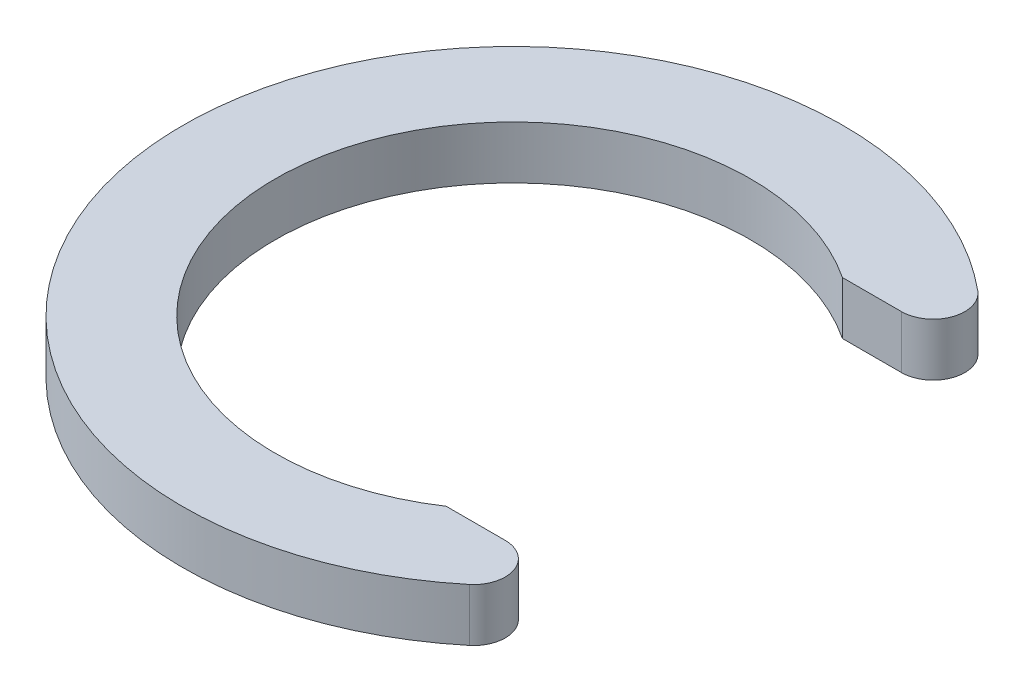
ISO-10303-21;
HEADER;
FILE_DESCRIPTION(('STEP AP214'),'2;1');
FILE_NAME('part.step','',(''),(''),'','','');
FILE_SCHEMA(('AUTOMOTIVE_DESIGN { 1 0 10303 214 1 1 1 1 }'));
ENDSEC;
DATA;
#1=APPLICATION_CONTEXT('core data for automotive mechanical design processes');
#2=APPLICATION_PROTOCOL_DEFINITION('international standard','automotive_design',2000,#1);
#3=PRODUCT_CONTEXT('',#1,'mechanical');
#4=PRODUCT('Part','Part','',(#3));
#5=PRODUCT_RELATED_PRODUCT_CATEGORY('part','',(#4));
#6=PRODUCT_DEFINITION_FORMATION('','',#4);
#7=PRODUCT_DEFINITION_CONTEXT('part definition',#1,'design');
#8=PRODUCT_DEFINITION('design','',#6,#7);
#9=PRODUCT_DEFINITION_SHAPE('','',#8);
#10=(LENGTH_UNIT() NAMED_UNIT(*) SI_UNIT(.MILLI.,.METRE.));
#11=(NAMED_UNIT(*) PLANE_ANGLE_UNIT() SI_UNIT($,.RADIAN.));
#12=(NAMED_UNIT(*) SI_UNIT($,.STERADIAN.) SOLID_ANGLE_UNIT());
#13=UNCERTAINTY_MEASURE_WITH_UNIT(LENGTH_MEASURE(1.E-05),#10,'distance_accuracy_value','');
#14=(GEOMETRIC_REPRESENTATION_CONTEXT(3) GLOBAL_UNCERTAINTY_ASSIGNED_CONTEXT((#13)) GLOBAL_UNIT_ASSIGNED_CONTEXT((#10,
#11,#12)) REPRESENTATION_CONTEXT('',''));
#15=CARTESIAN_POINT('',(0.,0.,0.));
#16=DIRECTION('',(0.,0.,1.));
#17=DIRECTION('',(1.,0.,0.));
#18=AXIS2_PLACEMENT_3D('',#15,#16,#17);
#19=CARTESIAN_POINT('',(0.,2.,0.));
#20=DIRECTION('',(0.,-1.,0.));
#21=DIRECTION('',(0.,0.,-1.));
#22=AXIS2_PLACEMENT_3D('',#19,#20,#21);
#23=CYLINDRICAL_SURFACE('',#22,9.);
#24=CARTESIAN_POINT('',(0.,0.,0.));
#25=DIRECTION('',(0.,-1.,0.));
#26=DIRECTION('',(0.,0.,1.));
#27=AXIS2_PLACEMENT_3D('',#24,#25,#26);
#28=CIRCLE('',#27,9.);
#29=CARTESIAN_POINT('',(4.9749371855331,0.,7.5));
#30=VERTEX_POINT('',#29);
#31=CARTESIAN_POINT('',(4.9749371855331,0.,-7.5));
#32=VERTEX_POINT('',#31);
#33=EDGE_CURVE('E112',#30,#32,#28,.T.);
#34=ORIENTED_EDGE('',*,*,#33,.T.);
#35=DIRECTION('',(0.,-1.,0.));
#36=VECTOR('',#35,1.);
#37=CARTESIAN_POINT('',(4.9749371855331,2.,-7.5));
#38=LINE('',#37,#36);
#39=CARTESIAN_POINT('',(4.9749371855331,2.,-7.5));
#40=VERTEX_POINT('',#39);
#41=EDGE_CURVE('E96',#40,#32,#38,.T.);
#42=ORIENTED_EDGE('',*,*,#41,.F.);
#43=CARTESIAN_POINT('',(0.,2.,0.));
#44=DIRECTION('',(0.,-1.,0.));
#45=DIRECTION('',(0.,0.,1.));
#46=AXIS2_PLACEMENT_3D('',#43,#44,#45);
#47=CIRCLE('',#46,9.);
#48=CARTESIAN_POINT('',(4.9749371855331,2.,7.5));
#49=VERTEX_POINT('',#48);
#50=EDGE_CURVE('E99',#49,#40,#47,.T.);
#51=ORIENTED_EDGE('',*,*,#50,.F.);
#52=DIRECTION('',(0.,-1.,0.));
#53=VECTOR('',#52,1.);
#54=CARTESIAN_POINT('',(4.9749371855331,2.,7.5));
#55=LINE('',#54,#53);
#56=EDGE_CURVE('E114',#49,#30,#55,.T.);
#57=ORIENTED_EDGE('',*,*,#56,.T.);
#58=EDGE_LOOP('',(#34,#42,#51,#57));
#59=FACE_BOUND('',#58,.T.);
#60=ADVANCED_FACE('F39',(#59),#23,.F.);
#61=CARTESIAN_POINT('',(4.9749371855331,2.,-7.5));
#62=DIRECTION('',(0.,0.,-1.));
#63=DIRECTION('',(-1.,0.,0.));
#64=AXIS2_PLACEMENT_3D('',#61,#62,#63);
#65=PLANE('',#64);
#66=DIRECTION('',(1.,0.,0.));
#67=VECTOR('',#66,1.);
#68=CARTESIAN_POINT('',(4.9749371855331,0.,-7.5));
#69=LINE('',#68,#67);
#70=CARTESIAN_POINT('',(7.21110255092798,0.,-7.5));
#71=VERTEX_POINT('',#70);
#72=EDGE_CURVE('E137',#32,#71,#69,.T.);
#73=ORIENTED_EDGE('',*,*,#72,.T.);
#74=DIRECTION('',(0.,-1.,0.));
#75=VECTOR('',#74,1.);
#76=CARTESIAN_POINT('',(7.21110255092798,2.,-7.5));
#77=LINE('',#76,#75);
#78=CARTESIAN_POINT('',(7.21110255092798,2.,-7.5));
#79=VERTEX_POINT('',#78);
#80=EDGE_CURVE('E65',#71,#79,#77,.F.);
#81=ORIENTED_EDGE('',*,*,#80,.T.);
#82=DIRECTION('',(1.,0.,0.));
#83=VECTOR('',#82,1.);
#84=CARTESIAN_POINT('',(4.9749371855331,2.,-7.5));
#85=LINE('',#84,#83);
#86=EDGE_CURVE('E95',#40,#79,#85,.T.);
#87=ORIENTED_EDGE('',*,*,#86,.F.);
#88=ORIENTED_EDGE('',*,*,#41,.T.);
#89=EDGE_LOOP('',(#73,#81,#87,#88));
#90=FACE_BOUND('',#89,.T.);
#91=ADVANCED_FACE('F94',(#90),#65,.F.);
#92=CARTESIAN_POINT('',(0.,2.,0.));
#93=DIRECTION('',(0.,-1.,0.));
#94=DIRECTION('',(0.,0.,-1.));
#95=AXIS2_PLACEMENT_3D('',#92,#93,#94);
#96=CYLINDRICAL_SURFACE('',#95,12.5);
#97=CARTESIAN_POINT('',(0.,2.,0.));
#98=DIRECTION('',(0.,1.,0.));
#99=DIRECTION('',(0.,0.,1.));
#100=AXIS2_PLACEMENT_3D('',#97,#98,#99);
#101=CIRCLE('',#100,12.5);
#102=CARTESIAN_POINT('',(7.97688335279644,2.,-9.62389380530973));
#103=VERTEX_POINT('',#102);
#104=CARTESIAN_POINT('',(7.97688335279644,2.,9.62389380530973));
#105=VERTEX_POINT('',#104);
#106=EDGE_CURVE('E97',#103,#105,#101,.T.);
#107=ORIENTED_EDGE('',*,*,#106,.F.);
#108=DIRECTION('',(0.,-1.,0.));
#109=VECTOR('',#108,1.);
#110=CARTESIAN_POINT('',(7.97688335279644,2.,-9.62389380530974));
#111=LINE('',#110,#109);
#112=CARTESIAN_POINT('',(7.97688335279644,0.,-9.62389380530973));
#113=VERTEX_POINT('',#112);
#114=EDGE_CURVE('E113',#103,#113,#111,.T.);
#115=ORIENTED_EDGE('',*,*,#114,.T.);
#116=CARTESIAN_POINT('',(0.,0.,0.));
#117=DIRECTION('',(0.,1.,0.));
#118=DIRECTION('',(0.,0.,1.));
#119=AXIS2_PLACEMENT_3D('',#116,#117,#118);
#120=CIRCLE('',#119,12.5);
#121=CARTESIAN_POINT('',(7.97688335279644,0.,9.62389380530973));
#122=VERTEX_POINT('',#121);
#123=EDGE_CURVE('E139',#113,#122,#120,.T.);
#124=ORIENTED_EDGE('',*,*,#123,.T.);
#125=DIRECTION('',(0.,-1.,0.));
#126=VECTOR('',#125,1.);
#127=CARTESIAN_POINT('',(7.97688335279644,2.,9.62389380530974));
#128=LINE('',#127,#126);
#129=EDGE_CURVE('E115',#122,#105,#128,.F.);
#130=ORIENTED_EDGE('',*,*,#129,.T.);
#131=EDGE_LOOP('',(#107,#115,#124,#130));
#132=FACE_BOUND('',#131,.T.);
#133=ADVANCED_FACE('F131',(#132),#96,.T.);
#134=CARTESIAN_POINT('',(4.9749371855331,2.,7.5));
#135=DIRECTION('',(0.,0.,1.));
#136=DIRECTION('',(1.,0.,0.));
#137=AXIS2_PLACEMENT_3D('',#134,#135,#136);
#138=PLANE('',#137);
#139=DIRECTION('',(-1.,0.,0.));
#140=VECTOR('',#139,1.);
#141=CARTESIAN_POINT('',(4.9749371855331,2.,7.5));
#142=LINE('',#141,#140);
#143=CARTESIAN_POINT('',(7.21110255092798,2.,7.5));
#144=VERTEX_POINT('',#143);
#145=EDGE_CURVE('E102',#144,#49,#142,.T.);
#146=ORIENTED_EDGE('',*,*,#145,.F.);
#147=DIRECTION('',(0.,-1.,0.));
#148=VECTOR('',#147,1.);
#149=CARTESIAN_POINT('',(7.21110255092798,2.,7.5));
#150=LINE('',#149,#148);
#151=CARTESIAN_POINT('',(7.21110255092798,0.,7.5));
#152=VERTEX_POINT('',#151);
#153=EDGE_CURVE('E11',#144,#152,#150,.T.);
#154=ORIENTED_EDGE('',*,*,#153,.T.);
#155=DIRECTION('',(-1.,0.,0.));
#156=VECTOR('',#155,1.);
#157=CARTESIAN_POINT('',(4.9749371855331,0.,7.5));
#158=LINE('',#157,#156);
#159=EDGE_CURVE('E107',#152,#30,#158,.T.);
#160=ORIENTED_EDGE('',*,*,#159,.T.);
#161=ORIENTED_EDGE('',*,*,#56,.F.);
#162=EDGE_LOOP('',(#146,#154,#160,#161));
#163=FACE_BOUND('',#162,.T.);
#164=ADVANCED_FACE('F150',(#163),#138,.F.);
#165=CARTESIAN_POINT('',(0.,2.,0.));
#166=DIRECTION('',(0.,1.,0.));
#167=DIRECTION('',(0.,0.,1.));
#168=AXIS2_PLACEMENT_3D('',#165,#166,#167);
#169=PLANE('',#168);
#170=ORIENTED_EDGE('',*,*,#86,.T.);
#171=CARTESIAN_POINT('',(7.21110255092798,2.,-8.7));
#172=DIRECTION('',(0.,1.,0.));
#173=DIRECTION('',(0.,0.,1.));
#174=AXIS2_PLACEMENT_3D('',#171,#172,#173);
#175=CIRCLE('',#174,1.2);
#176=EDGE_CURVE('E50',#79,#103,#175,.T.);
#177=ORIENTED_EDGE('',*,*,#176,.T.);
#178=ORIENTED_EDGE('',*,*,#106,.T.);
#179=CARTESIAN_POINT('',(7.21110255092798,2.,8.7));
#180=DIRECTION('',(0.,1.,0.));
#181=DIRECTION('',(0.,0.,1.));
#182=AXIS2_PLACEMENT_3D('',#179,#180,#181);
#183=CIRCLE('',#182,1.2);
#184=EDGE_CURVE('E53',#105,#144,#183,.T.);
#185=ORIENTED_EDGE('',*,*,#184,.T.);
#186=ORIENTED_EDGE('',*,*,#145,.T.);
#187=ORIENTED_EDGE('',*,*,#50,.T.);
#188=EDGE_LOOP('',(#170,#177,#178,#185,#186,#187));
#189=FACE_BOUND('',#188,.T.);
#190=ADVANCED_FACE('F103',(#189),#169,.T.);
#191=CARTESIAN_POINT('',(0.,0.,0.));
#192=DIRECTION('',(0.,1.,0.));
#193=DIRECTION('',(0.,0.,1.));
#194=AXIS2_PLACEMENT_3D('',#191,#192,#193);
#195=PLANE('',#194);
#196=ORIENTED_EDGE('',*,*,#123,.F.);
#197=CARTESIAN_POINT('',(7.21110255092798,0.,-8.7));
#198=DIRECTION('',(0.,1.,0.));
#199=DIRECTION('',(0.,0.,1.));
#200=AXIS2_PLACEMENT_3D('',#197,#198,#199);
#201=CIRCLE('',#200,1.2);
#202=EDGE_CURVE('E122',#113,#71,#201,.F.);
#203=ORIENTED_EDGE('',*,*,#202,.T.);
#204=ORIENTED_EDGE('',*,*,#72,.F.);
#205=ORIENTED_EDGE('',*,*,#33,.F.);
#206=ORIENTED_EDGE('',*,*,#159,.F.);
#207=CARTESIAN_POINT('',(7.21110255092798,0.,8.7));
#208=DIRECTION('',(0.,1.,0.));
#209=DIRECTION('',(0.,0.,1.));
#210=AXIS2_PLACEMENT_3D('',#207,#208,#209);
#211=CIRCLE('',#210,1.2);
#212=EDGE_CURVE('E125',#152,#122,#211,.F.);
#213=ORIENTED_EDGE('',*,*,#212,.T.);
#214=EDGE_LOOP('',(#196,#203,#204,#205,#206,#213));
#215=FACE_BOUND('',#214,.T.);
#216=ADVANCED_FACE('F136',(#215),#195,.F.);
#217=CARTESIAN_POINT('',(7.21110255092798,2.,-8.7));
#218=DIRECTION('',(0.,-1.,0.));
#219=DIRECTION('',(0.,0.,-1.));
#220=AXIS2_PLACEMENT_3D('',#217,#218,#219);
#221=CYLINDRICAL_SURFACE('',#220,1.2);
#222=ORIENTED_EDGE('',*,*,#176,.F.);
#223=ORIENTED_EDGE('',*,*,#80,.F.);
#224=ORIENTED_EDGE('',*,*,#202,.F.);
#225=ORIENTED_EDGE('',*,*,#114,.F.);
#226=EDGE_LOOP('',(#222,#223,#224,#225));
#227=FACE_BOUND('',#226,.T.);
#228=ADVANCED_FACE('F138',(#227),#221,.T.);
#229=CARTESIAN_POINT('',(7.21110255092798,2.,8.7));
#230=DIRECTION('',(0.,-1.,0.));
#231=DIRECTION('',(0.,0.,-1.));
#232=AXIS2_PLACEMENT_3D('',#229,#230,#231);
#233=CYLINDRICAL_SURFACE('',#232,1.2);
#234=ORIENTED_EDGE('',*,*,#184,.F.);
#235=ORIENTED_EDGE('',*,*,#129,.F.);
#236=ORIENTED_EDGE('',*,*,#212,.F.);
#237=ORIENTED_EDGE('',*,*,#153,.F.);
#238=EDGE_LOOP('',(#234,#235,#236,#237));
#239=FACE_BOUND('',#238,.T.);
#240=ADVANCED_FACE('F41',(#239),#233,.T.);
#241=CLOSED_SHELL('',(#60,#91,#133,#164,#190,#216,#228,#240));
#242=MANIFOLD_SOLID_BREP('B2',#241);
#243=ADVANCED_BREP_SHAPE_REPRESENTATION('',(#18,#242),#14);
#244=SHAPE_DEFINITION_REPRESENTATION(#9,#243);
ENDSEC;
END-ISO-10303-21;
